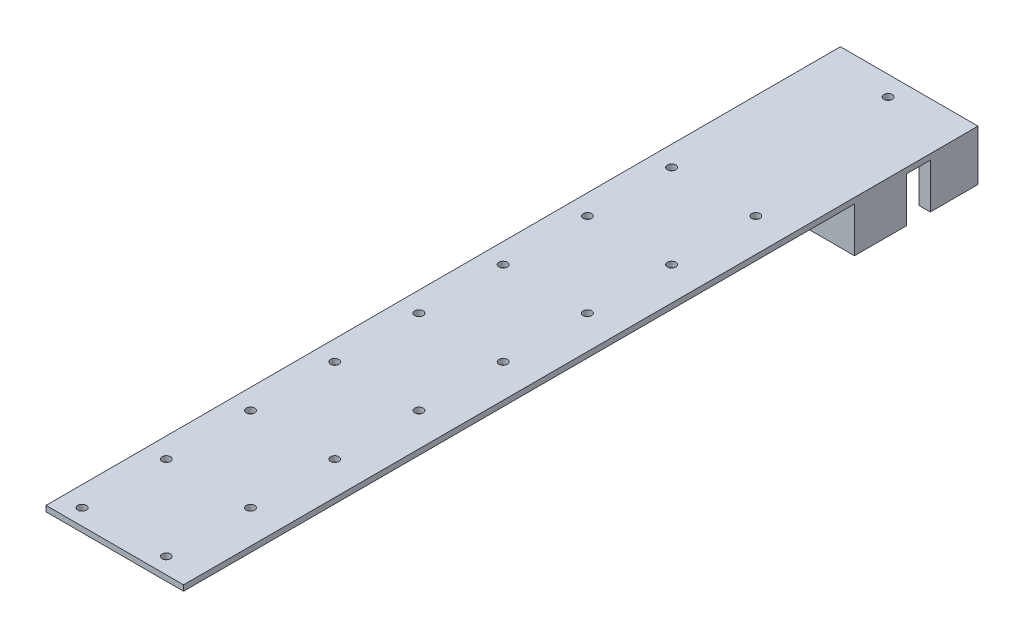
ISO-10303-21;
HEADER;
FILE_DESCRIPTION(('STEP AP214'),'2;1');
FILE_NAME('part.step','',(''),(''),'','','');
FILE_SCHEMA(('AUTOMOTIVE_DESIGN { 1 0 10303 214 1 1 1 1 }'));
ENDSEC;
DATA;
#1=APPLICATION_CONTEXT('core data for automotive mechanical design processes');
#2=APPLICATION_PROTOCOL_DEFINITION('international standard','automotive_design',2000,#1);
#3=PRODUCT_CONTEXT('',#1,'mechanical');
#4=PRODUCT('Part','Part','',(#3));
#5=PRODUCT_RELATED_PRODUCT_CATEGORY('part','',(#4));
#6=PRODUCT_DEFINITION_FORMATION('','',#4);
#7=PRODUCT_DEFINITION_CONTEXT('part definition',#1,'design');
#8=PRODUCT_DEFINITION('design','',#6,#7);
#9=PRODUCT_DEFINITION_SHAPE('','',#8);
#10=(LENGTH_UNIT() NAMED_UNIT(*) SI_UNIT(.MILLI.,.METRE.));
#11=(NAMED_UNIT(*) PLANE_ANGLE_UNIT() SI_UNIT($,.RADIAN.));
#12=(NAMED_UNIT(*) SI_UNIT($,.STERADIAN.) SOLID_ANGLE_UNIT());
#13=UNCERTAINTY_MEASURE_WITH_UNIT(LENGTH_MEASURE(1.E-05),#10,'distance_accuracy_value','');
#14=(GEOMETRIC_REPRESENTATION_CONTEXT(3) GLOBAL_UNCERTAINTY_ASSIGNED_CONTEXT((#13)) GLOBAL_UNIT_ASSIGNED_CONTEXT((#10,
#11,#12)) REPRESENTATION_CONTEXT('',''));
#15=CARTESIAN_POINT('',(0.,0.,0.));
#16=DIRECTION('',(0.,0.,1.));
#17=DIRECTION('',(1.,0.,0.));
#18=AXIS2_PLACEMENT_3D('',#15,#16,#17);
#19=CARTESIAN_POINT('',(0.,0.,0.));
#20=DIRECTION('',(0.,-1.,0.));
#21=DIRECTION('',(0.,0.,-1.));
#22=AXIS2_PLACEMENT_3D('',#19,#20,#21);
#23=PLANE('',#22);
#24=CARTESIAN_POINT('',(-0.5,0.,-134.5));
#25=DIRECTION('',(0.,-1.,0.));
#26=DIRECTION('',(0.,0.,-1.));
#27=AXIS2_PLACEMENT_3D('',#24,#25,#26);
#28=CIRCLE('',#27,1.5);
#29=CARTESIAN_POINT('',(-0.5,0.,-136.));
#30=VERTEX_POINT('',#29);
#31=EDGE_CURVE('E881',#30,#30,#28,.T.);
#32=ORIENTED_EDGE('',*,*,#31,.F.);
#33=EDGE_LOOP('',(#32));
#34=FACE_BOUND('',#33,.T.);
#35=CARTESIAN_POINT('',(12.6500000000019,0.,105.8));
#36=DIRECTION('',(0.,1.,0.));
#37=DIRECTION('',(0.,0.,1.));
#38=AXIS2_PLACEMENT_3D('',#35,#36,#37);
#39=CIRCLE('',#38,1.5);
#40=CARTESIAN_POINT('',(12.6500000000019,0.,107.3));
#41=VERTEX_POINT('',#40);
#42=EDGE_CURVE('E260',#41,#41,#39,.T.);
#43=ORIENTED_EDGE('',*,*,#42,.T.);
#44=EDGE_LOOP('',(#43));
#45=FACE_BOUND('',#44,.T.);
#46=CARTESIAN_POINT('',(12.6500000000013,0.,45.8000000000003));
#47=DIRECTION('',(0.,1.,0.));
#48=DIRECTION('',(0.,0.,1.));
#49=AXIS2_PLACEMENT_3D('',#46,#47,#48);
#50=CIRCLE('',#49,1.5);
#51=CARTESIAN_POINT('',(12.6500000000013,0.,47.3000000000003));
#52=VERTEX_POINT('',#51);
#53=EDGE_CURVE('E276',#52,#52,#50,.T.);
#54=ORIENTED_EDGE('',*,*,#53,.T.);
#55=EDGE_LOOP('',(#54));
#56=FACE_BOUND('',#55,.T.);
#57=CARTESIAN_POINT('',(12.6500000000006,0.,-14.1999999999997));
#58=DIRECTION('',(0.,1.,0.));
#59=DIRECTION('',(0.,0.,1.));
#60=AXIS2_PLACEMENT_3D('',#57,#58,#59);
#61=CIRCLE('',#60,1.5);
#62=CARTESIAN_POINT('',(12.6500000000006,0.,-12.6999999999997));
#63=VERTEX_POINT('',#62);
#64=EDGE_CURVE('E292',#63,#63,#61,.T.);
#65=ORIENTED_EDGE('',*,*,#64,.T.);
#66=EDGE_LOOP('',(#65));
#67=FACE_BOUND('',#66,.T.);
#68=CARTESIAN_POINT('',(-17.3499999999978,0.,135.8));
#69=DIRECTION('',(0.,1.,0.));
#70=DIRECTION('',(0.,0.,1.));
#71=AXIS2_PLACEMENT_3D('',#68,#69,#70);
#72=CIRCLE('',#71,1.5);
#73=CARTESIAN_POINT('',(-17.3499999999978,0.,137.3));
#74=VERTEX_POINT('',#73);
#75=EDGE_CURVE('E308',#74,#74,#72,.T.);
#76=ORIENTED_EDGE('',*,*,#75,.T.);
#77=EDGE_LOOP('',(#76));
#78=FACE_BOUND('',#77,.T.);
#79=CARTESIAN_POINT('',(-17.3499999999984,0.,75.8000000000005));
#80=DIRECTION('',(0.,1.,0.));
#81=DIRECTION('',(0.,0.,1.));
#82=AXIS2_PLACEMENT_3D('',#79,#80,#81);
#83=CIRCLE('',#82,1.5);
#84=CARTESIAN_POINT('',(-17.3499999999984,0.,77.3000000000005));
#85=VERTEX_POINT('',#84);
#86=EDGE_CURVE('E324',#85,#85,#83,.T.);
#87=ORIENTED_EDGE('',*,*,#86,.T.);
#88=EDGE_LOOP('',(#87));
#89=FACE_BOUND('',#88,.T.);
#90=CARTESIAN_POINT('',(-17.3499999999991,0.,15.8000000000005));
#91=DIRECTION('',(0.,1.,0.));
#92=DIRECTION('',(0.,0.,1.));
#93=AXIS2_PLACEMENT_3D('',#90,#91,#92);
#94=CIRCLE('',#93,1.5);
#95=CARTESIAN_POINT('',(-17.3499999999991,0.,17.3000000000005));
#96=VERTEX_POINT('',#95);
#97=EDGE_CURVE('E340',#96,#96,#94,.T.);
#98=ORIENTED_EDGE('',*,*,#97,.T.);
#99=EDGE_LOOP('',(#98));
#100=FACE_BOUND('',#99,.T.);
#101=CARTESIAN_POINT('',(-17.3499999999997,0.,-44.1999999999995));
#102=DIRECTION('',(0.,1.,0.));
#103=DIRECTION('',(0.,0.,1.));
#104=AXIS2_PLACEMENT_3D('',#101,#102,#103);
#105=CIRCLE('',#104,1.5);
#106=CARTESIAN_POINT('',(-17.3499999999997,0.,-42.6999999999995));
#107=VERTEX_POINT('',#106);
#108=EDGE_CURVE('E356',#107,#107,#105,.T.);
#109=ORIENTED_EDGE('',*,*,#108,.T.);
#110=EDGE_LOOP('',(#109));
#111=FACE_BOUND('',#110,.T.);
#112=CARTESIAN_POINT('',(12.65,0.,-74.1999999999997));
#113=DIRECTION('',(0.,1.,0.));
#114=DIRECTION('',(0.,0.,1.));
#115=AXIS2_PLACEMENT_3D('',#112,#113,#114);
#116=CIRCLE('',#115,1.5);
#117=CARTESIAN_POINT('',(12.65,0.,-72.6999999999997));
#118=VERTEX_POINT('',#117);
#119=EDGE_CURVE('E372',#118,#118,#116,.T.);
#120=ORIENTED_EDGE('',*,*,#119,.T.);
#121=EDGE_LOOP('',(#120));
#122=FACE_BOUND('',#121,.T.);
#123=CARTESIAN_POINT('',(-17.35,0.,-74.1999999999995));
#124=DIRECTION('',(0.,1.,0.));
#125=DIRECTION('',(0.,0.,1.));
#126=AXIS2_PLACEMENT_3D('',#123,#124,#125);
#127=CIRCLE('',#126,1.5);
#128=CARTESIAN_POINT('',(-17.35,0.,-72.6999999999995));
#129=VERTEX_POINT('',#128);
#130=EDGE_CURVE('E364',#129,#129,#127,.T.);
#131=ORIENTED_EDGE('',*,*,#130,.T.);
#132=EDGE_LOOP('',(#131));
#133=FACE_BOUND('',#132,.T.);
#134=CARTESIAN_POINT('',(-17.3499999999994,0.,-14.1999999999995));
#135=DIRECTION('',(0.,1.,0.));
#136=DIRECTION('',(0.,0.,1.));
#137=AXIS2_PLACEMENT_3D('',#134,#135,#136);
#138=CIRCLE('',#137,1.5);
#139=CARTESIAN_POINT('',(-17.3499999999994,0.,-12.6999999999995));
#140=VERTEX_POINT('',#139);
#141=EDGE_CURVE('E348',#140,#140,#138,.T.);
#142=ORIENTED_EDGE('',*,*,#141,.T.);
#143=EDGE_LOOP('',(#142));
#144=FACE_BOUND('',#143,.T.);
#145=CARTESIAN_POINT('',(-17.3499999999987,0.,45.8000000000005));
#146=DIRECTION('',(0.,1.,0.));
#147=DIRECTION('',(0.,0.,1.));
#148=AXIS2_PLACEMENT_3D('',#145,#146,#147);
#149=CIRCLE('',#148,1.5);
#150=CARTESIAN_POINT('',(-17.3499999999987,0.,47.3000000000005));
#151=VERTEX_POINT('',#150);
#152=EDGE_CURVE('E332',#151,#151,#149,.T.);
#153=ORIENTED_EDGE('',*,*,#152,.T.);
#154=EDGE_LOOP('',(#153));
#155=FACE_BOUND('',#154,.T.);
#156=CARTESIAN_POINT('',(-17.3499999999981,0.,105.800000000001));
#157=DIRECTION('',(0.,1.,0.));
#158=DIRECTION('',(0.,0.,1.));
#159=AXIS2_PLACEMENT_3D('',#156,#157,#158);
#160=CIRCLE('',#159,1.5);
#161=CARTESIAN_POINT('',(-17.3499999999981,0.,107.300000000001));
#162=VERTEX_POINT('',#161);
#163=EDGE_CURVE('E316',#162,#162,#160,.T.);
#164=ORIENTED_EDGE('',*,*,#163,.T.);
#165=EDGE_LOOP('',(#164));
#166=FACE_BOUND('',#165,.T.);
#167=CARTESIAN_POINT('',(12.6500000000003,0.,-44.1999999999997));
#168=DIRECTION('',(0.,1.,0.));
#169=DIRECTION('',(0.,0.,1.));
#170=AXIS2_PLACEMENT_3D('',#167,#168,#169);
#171=CIRCLE('',#170,1.5);
#172=CARTESIAN_POINT('',(12.6500000000003,0.,-42.6999999999997));
#173=VERTEX_POINT('',#172);
#174=EDGE_CURVE('E300',#173,#173,#171,.T.);
#175=ORIENTED_EDGE('',*,*,#174,.T.);
#176=EDGE_LOOP('',(#175));
#177=FACE_BOUND('',#176,.T.);
#178=CARTESIAN_POINT('',(12.6500000000009,0.,15.8000000000003));
#179=DIRECTION('',(0.,1.,0.));
#180=DIRECTION('',(0.,0.,1.));
#181=AXIS2_PLACEMENT_3D('',#178,#179,#180);
#182=CIRCLE('',#181,1.5);
#183=CARTESIAN_POINT('',(12.6500000000009,0.,17.3000000000003));
#184=VERTEX_POINT('',#183);
#185=EDGE_CURVE('E284',#184,#184,#182,.T.);
#186=ORIENTED_EDGE('',*,*,#185,.T.);
#187=EDGE_LOOP('',(#186));
#188=FACE_BOUND('',#187,.T.);
#189=CARTESIAN_POINT('',(12.6500000000016,0.,75.8000000000003));
#190=DIRECTION('',(0.,1.,0.));
#191=DIRECTION('',(0.,0.,1.));
#192=AXIS2_PLACEMENT_3D('',#189,#190,#191);
#193=CIRCLE('',#192,1.5);
#194=CARTESIAN_POINT('',(12.6500000000016,0.,77.3000000000003));
#195=VERTEX_POINT('',#194);
#196=EDGE_CURVE('E268',#195,#195,#193,.T.);
#197=ORIENTED_EDGE('',*,*,#196,.T.);
#198=EDGE_LOOP('',(#197));
#199=FACE_BOUND('',#198,.T.);
#200=CARTESIAN_POINT('',(12.6500000000022,0.,135.8));
#201=DIRECTION('',(0.,1.,0.));
#202=DIRECTION('',(0.,0.,1.));
#203=AXIS2_PLACEMENT_3D('',#200,#201,#202);
#204=CIRCLE('',#203,1.5);
#205=CARTESIAN_POINT('',(12.6500000000022,0.,137.3));
#206=VERTEX_POINT('',#205);
#207=EDGE_CURVE('E255',#206,#206,#204,.T.);
#208=ORIENTED_EDGE('',*,*,#207,.T.);
#209=EDGE_LOOP('',(#208));
#210=FACE_BOUND('',#209,.T.);
#211=DIRECTION('',(-1.,0.,0.));
#212=VECTOR('',#211,1.);
#213=CARTESIAN_POINT('',(-24.5,0.,-141.5));
#214=LINE('',#213,#212);
#215=CARTESIAN_POINT('',(20.5,0.,-141.5));
#216=VERTEX_POINT('',#215);
#217=CARTESIAN_POINT('',(-19.1,0.,-141.5));
#218=VERTEX_POINT('',#217);
#219=EDGE_CURVE('E404',#216,#218,#214,.T.);
#220=ORIENTED_EDGE('',*,*,#219,.F.);
#221=DIRECTION('',(0.,0.,-1.));
#222=VECTOR('',#221,1.);
#223=CARTESIAN_POINT('',(20.5,0.,-124.5));
#224=LINE('',#223,#222);
#225=CARTESIAN_POINT('',(20.5,0.,-124.5));
#226=VERTEX_POINT('',#225);
#227=EDGE_CURVE('E56',#226,#216,#224,.T.);
#228=ORIENTED_EDGE('',*,*,#227,.F.);
#229=DIRECTION('',(-1.,0.,0.));
#230=VECTOR('',#229,1.);
#231=CARTESIAN_POINT('',(20.5,0.,-124.5));
#232=LINE('',#231,#230);
#233=CARTESIAN_POINT('',(24.5,0.,-124.5));
#234=VERTEX_POINT('',#233);
#235=EDGE_CURVE('E168',#234,#226,#232,.T.);
#236=ORIENTED_EDGE('',*,*,#235,.F.);
#237=DIRECTION('',(0.,0.,-1.));
#238=VECTOR('',#237,1.);
#239=CARTESIAN_POINT('',(24.5,0.,141.5));
#240=LINE('',#239,#238);
#241=CARTESIAN_POINT('',(24.5,0.,-116.1));
#242=VERTEX_POINT('',#241);
#243=EDGE_CURVE('E380',#242,#234,#240,.T.);
#244=ORIENTED_EDGE('',*,*,#243,.F.);
#245=DIRECTION('',(1.,0.,0.));
#246=VECTOR('',#245,1.);
#247=CARTESIAN_POINT('',(-18.3,0.,-116.1));
#248=LINE('',#247,#246);
#249=CARTESIAN_POINT('',(-18.3,0.,-116.1));
#250=VERTEX_POINT('',#249);
#251=EDGE_CURVE('E233',#250,#242,#248,.T.);
#252=ORIENTED_EDGE('',*,*,#251,.F.);
#253=DIRECTION('',(0.,0.,-1.));
#254=VECTOR('',#253,1.);
#255=CARTESIAN_POINT('',(-18.3,0.,-97.4999999999997));
#256=LINE('',#255,#254);
#257=CARTESIAN_POINT('',(-18.3,0.,-97.4999999999997));
#258=VERTEX_POINT('',#257);
#259=EDGE_CURVE('E214',#258,#250,#256,.T.);
#260=ORIENTED_EDGE('',*,*,#259,.F.);
#261=DIRECTION('',(-1.,0.,0.));
#262=VECTOR('',#261,1.);
#263=CARTESIAN_POINT('',(-18.3,0.,-97.4999999999997));
#264=LINE('',#263,#262);
#265=CARTESIAN_POINT('',(24.5,0.,-97.4999999999997));
#266=VERTEX_POINT('',#265);
#267=EDGE_CURVE('E220',#266,#258,#264,.T.);
#268=ORIENTED_EDGE('',*,*,#267,.F.);
#269=CARTESIAN_POINT('',(24.5,0.,141.5));
#270=VERTEX_POINT('',#269);
#271=EDGE_CURVE('E399',#270,#266,#240,.T.);
#272=ORIENTED_EDGE('',*,*,#271,.F.);
#273=DIRECTION('',(1.,0.,0.));
#274=VECTOR('',#273,1.);
#275=CARTESIAN_POINT('',(-24.5,0.,141.5));
#276=LINE('',#275,#274);
#277=CARTESIAN_POINT('',(-24.5,0.,141.5));
#278=VERTEX_POINT('',#277);
#279=EDGE_CURVE('E389',#278,#270,#276,.T.);
#280=ORIENTED_EDGE('',*,*,#279,.F.);
#281=DIRECTION('',(0.,0.,1.));
#282=VECTOR('',#281,1.);
#283=CARTESIAN_POINT('',(-24.5,0.,141.5));
#284=LINE('',#283,#282);
#285=CARTESIAN_POINT('',(-24.5,0.,-141.5));
#286=VERTEX_POINT('',#285);
#287=EDGE_CURVE('E407',#286,#278,#284,.T.);
#288=ORIENTED_EDGE('',*,*,#287,.F.);
#289=CARTESIAN_POINT('',(-23.1,0.,-141.5));
#290=VERTEX_POINT('',#289);
#291=EDGE_CURVE('E403',#290,#286,#214,.T.);
#292=ORIENTED_EDGE('',*,*,#291,.F.);
#293=DIRECTION('',(0.,0.,-1.));
#294=VECTOR('',#293,1.);
#295=CARTESIAN_POINT('',(-23.1,0.,-124.5));
#296=LINE('',#295,#294);
#297=CARTESIAN_POINT('',(-23.1,0.,-124.5));
#298=VERTEX_POINT('',#297);
#299=EDGE_CURVE('E64',#298,#290,#296,.T.);
#300=ORIENTED_EDGE('',*,*,#299,.F.);
#301=DIRECTION('',(-1.,0.,0.));
#302=VECTOR('',#301,1.);
#303=CARTESIAN_POINT('',(-23.1,0.,-124.5));
#304=LINE('',#303,#302);
#305=CARTESIAN_POINT('',(-19.1,0.,-124.5));
#306=VERTEX_POINT('',#305);
#307=EDGE_CURVE('E187',#306,#298,#304,.T.);
#308=ORIENTED_EDGE('',*,*,#307,.F.);
#309=DIRECTION('',(0.,0.,1.));
#310=VECTOR('',#309,1.);
#311=CARTESIAN_POINT('',(-19.1,0.,-124.5));
#312=LINE('',#311,#310);
#313=EDGE_CURVE('E176',#218,#306,#312,.T.);
#314=ORIENTED_EDGE('',*,*,#313,.F.);
#315=EDGE_LOOP('',(#220,#228,#236,#244,#252,#260,#268,#272,#280,#288,#292,#300,#308,#314));
#316=FACE_BOUND('',#315,.T.);
#317=ADVANCED_FACE('F39',(#34,#45,#56,#67,#78,#89,#100,#111,#122,#133,#144,#155,#166,#177,#188,
#199,#210,#316),#23,.T.);
#318=CARTESIAN_POINT('',(0.,2.,0.));
#319=DIRECTION('',(0.,-1.,0.));
#320=DIRECTION('',(0.,0.,-1.));
#321=AXIS2_PLACEMENT_3D('',#318,#319,#320);
#322=PLANE('',#321);
#323=CARTESIAN_POINT('',(-0.5,2.,-134.5));
#324=DIRECTION('',(0.,-1.,0.));
#325=DIRECTION('',(0.,0.,-1.));
#326=AXIS2_PLACEMENT_3D('',#323,#324,#325);
#327=CIRCLE('',#326,1.5);
#328=CARTESIAN_POINT('',(-0.5,2.,-136.));
#329=VERTEX_POINT('',#328);
#330=EDGE_CURVE('E43',#329,#329,#327,.T.);
#331=ORIENTED_EDGE('',*,*,#330,.T.);
#332=EDGE_LOOP('',(#331));
#333=FACE_BOUND('',#332,.T.);
#334=DIRECTION('',(0.,0.,-1.));
#335=VECTOR('',#334,1.);
#336=CARTESIAN_POINT('',(24.5,2.,141.5));
#337=LINE('',#336,#335);
#338=CARTESIAN_POINT('',(24.5,2.,141.5));
#339=VERTEX_POINT('',#338);
#340=CARTESIAN_POINT('',(24.5,2.,-141.5));
#341=VERTEX_POINT('',#340);
#342=EDGE_CURVE('E384',#339,#341,#337,.T.);
#343=ORIENTED_EDGE('',*,*,#342,.T.);
#344=DIRECTION('',(-1.,0.,0.));
#345=VECTOR('',#344,1.);
#346=CARTESIAN_POINT('',(-24.5,2.,-141.5));
#347=LINE('',#346,#345);
#348=CARTESIAN_POINT('',(-24.5,2.,-141.5));
#349=VERTEX_POINT('',#348);
#350=EDGE_CURVE('E388',#341,#349,#347,.T.);
#351=ORIENTED_EDGE('',*,*,#350,.T.);
#352=DIRECTION('',(0.,0.,1.));
#353=VECTOR('',#352,1.);
#354=CARTESIAN_POINT('',(-24.5,2.,141.5));
#355=LINE('',#354,#353);
#356=CARTESIAN_POINT('',(-24.5,2.,141.5));
#357=VERTEX_POINT('',#356);
#358=EDGE_CURVE('E392',#349,#357,#355,.T.);
#359=ORIENTED_EDGE('',*,*,#358,.T.);
#360=DIRECTION('',(1.,0.,0.));
#361=VECTOR('',#360,1.);
#362=CARTESIAN_POINT('',(-24.5,2.,141.5));
#363=LINE('',#362,#361);
#364=EDGE_CURVE('E395',#357,#339,#363,.T.);
#365=ORIENTED_EDGE('',*,*,#364,.T.);
#366=EDGE_LOOP('',(#343,#351,#359,#365));
#367=FACE_BOUND('',#366,.T.);
#368=CARTESIAN_POINT('',(12.65,2.,-74.1999999999997));
#369=DIRECTION('',(0.,1.,0.));
#370=DIRECTION('',(0.,0.,1.));
#371=AXIS2_PLACEMENT_3D('',#368,#369,#370);
#372=CIRCLE('',#371,1.5);
#373=CARTESIAN_POINT('',(12.65,2.,-72.6999999999997));
#374=VERTEX_POINT('',#373);
#375=EDGE_CURVE('E376',#374,#374,#372,.T.);
#376=ORIENTED_EDGE('',*,*,#375,.F.);
#377=EDGE_LOOP('',(#376));
#378=FACE_BOUND('',#377,.T.);
#379=CARTESIAN_POINT('',(-17.35,2.,-74.1999999999995));
#380=DIRECTION('',(0.,1.,0.));
#381=DIRECTION('',(0.,0.,1.));
#382=AXIS2_PLACEMENT_3D('',#379,#380,#381);
#383=CIRCLE('',#382,1.5);
#384=CARTESIAN_POINT('',(-17.35,2.,-72.6999999999995));
#385=VERTEX_POINT('',#384);
#386=EDGE_CURVE('E368',#385,#385,#383,.T.);
#387=ORIENTED_EDGE('',*,*,#386,.F.);
#388=EDGE_LOOP('',(#387));
#389=FACE_BOUND('',#388,.T.);
#390=CARTESIAN_POINT('',(-17.3499999999997,2.,-44.1999999999995));
#391=DIRECTION('',(0.,1.,0.));
#392=DIRECTION('',(0.,0.,1.));
#393=AXIS2_PLACEMENT_3D('',#390,#391,#392);
#394=CIRCLE('',#393,1.5);
#395=CARTESIAN_POINT('',(-17.3499999999997,2.,-42.6999999999995));
#396=VERTEX_POINT('',#395);
#397=EDGE_CURVE('E360',#396,#396,#394,.T.);
#398=ORIENTED_EDGE('',*,*,#397,.F.);
#399=EDGE_LOOP('',(#398));
#400=FACE_BOUND('',#399,.T.);
#401=CARTESIAN_POINT('',(-17.3499999999994,2.,-14.1999999999995));
#402=DIRECTION('',(0.,1.,0.));
#403=DIRECTION('',(0.,0.,1.));
#404=AXIS2_PLACEMENT_3D('',#401,#402,#403);
#405=CIRCLE('',#404,1.5);
#406=CARTESIAN_POINT('',(-17.3499999999994,2.,-12.6999999999995));
#407=VERTEX_POINT('',#406);
#408=EDGE_CURVE('E352',#407,#407,#405,.T.);
#409=ORIENTED_EDGE('',*,*,#408,.F.);
#410=EDGE_LOOP('',(#409));
#411=FACE_BOUND('',#410,.T.);
#412=CARTESIAN_POINT('',(-17.3499999999991,2.,15.8000000000005));
#413=DIRECTION('',(0.,1.,0.));
#414=DIRECTION('',(0.,0.,1.));
#415=AXIS2_PLACEMENT_3D('',#412,#413,#414);
#416=CIRCLE('',#415,1.5);
#417=CARTESIAN_POINT('',(-17.3499999999991,2.,17.3000000000005));
#418=VERTEX_POINT('',#417);
#419=EDGE_CURVE('E344',#418,#418,#416,.T.);
#420=ORIENTED_EDGE('',*,*,#419,.F.);
#421=EDGE_LOOP('',(#420));
#422=FACE_BOUND('',#421,.T.);
#423=CARTESIAN_POINT('',(-17.3499999999987,2.,45.8000000000005));
#424=DIRECTION('',(0.,1.,0.));
#425=DIRECTION('',(0.,0.,1.));
#426=AXIS2_PLACEMENT_3D('',#423,#424,#425);
#427=CIRCLE('',#426,1.5);
#428=CARTESIAN_POINT('',(-17.3499999999987,2.,47.3000000000005));
#429=VERTEX_POINT('',#428);
#430=EDGE_CURVE('E336',#429,#429,#427,.T.);
#431=ORIENTED_EDGE('',*,*,#430,.F.);
#432=EDGE_LOOP('',(#431));
#433=FACE_BOUND('',#432,.T.);
#434=CARTESIAN_POINT('',(-17.3499999999984,2.,75.8000000000005));
#435=DIRECTION('',(0.,1.,0.));
#436=DIRECTION('',(0.,0.,1.));
#437=AXIS2_PLACEMENT_3D('',#434,#435,#436);
#438=CIRCLE('',#437,1.5);
#439=CARTESIAN_POINT('',(-17.3499999999984,2.,77.3000000000005));
#440=VERTEX_POINT('',#439);
#441=EDGE_CURVE('E328',#440,#440,#438,.T.);
#442=ORIENTED_EDGE('',*,*,#441,.F.);
#443=EDGE_LOOP('',(#442));
#444=FACE_BOUND('',#443,.T.);
#445=CARTESIAN_POINT('',(-17.3499999999981,2.,105.800000000001));
#446=DIRECTION('',(0.,1.,0.));
#447=DIRECTION('',(0.,0.,1.));
#448=AXIS2_PLACEMENT_3D('',#445,#446,#447);
#449=CIRCLE('',#448,1.5);
#450=CARTESIAN_POINT('',(-17.3499999999981,2.,107.300000000001));
#451=VERTEX_POINT('',#450);
#452=EDGE_CURVE('E320',#451,#451,#449,.T.);
#453=ORIENTED_EDGE('',*,*,#452,.F.);
#454=EDGE_LOOP('',(#453));
#455=FACE_BOUND('',#454,.T.);
#456=CARTESIAN_POINT('',(-17.3499999999978,2.,135.8));
#457=DIRECTION('',(0.,1.,0.));
#458=DIRECTION('',(0.,0.,1.));
#459=AXIS2_PLACEMENT_3D('',#456,#457,#458);
#460=CIRCLE('',#459,1.5);
#461=CARTESIAN_POINT('',(-17.3499999999978,2.,137.3));
#462=VERTEX_POINT('',#461);
#463=EDGE_CURVE('E312',#462,#462,#460,.T.);
#464=ORIENTED_EDGE('',*,*,#463,.F.);
#465=EDGE_LOOP('',(#464));
#466=FACE_BOUND('',#465,.T.);
#467=CARTESIAN_POINT('',(12.6500000000003,2.,-44.1999999999997));
#468=DIRECTION('',(0.,1.,0.));
#469=DIRECTION('',(0.,0.,1.));
#470=AXIS2_PLACEMENT_3D('',#467,#468,#469);
#471=CIRCLE('',#470,1.5);
#472=CARTESIAN_POINT('',(12.6500000000003,2.,-42.6999999999997));
#473=VERTEX_POINT('',#472);
#474=EDGE_CURVE('E304',#473,#473,#471,.T.);
#475=ORIENTED_EDGE('',*,*,#474,.F.);
#476=EDGE_LOOP('',(#475));
#477=FACE_BOUND('',#476,.T.);
#478=CARTESIAN_POINT('',(12.6500000000006,2.,-14.1999999999997));
#479=DIRECTION('',(0.,1.,0.));
#480=DIRECTION('',(0.,0.,1.));
#481=AXIS2_PLACEMENT_3D('',#478,#479,#480);
#482=CIRCLE('',#481,1.5);
#483=CARTESIAN_POINT('',(12.6500000000006,2.,-12.6999999999997));
#484=VERTEX_POINT('',#483);
#485=EDGE_CURVE('E296',#484,#484,#482,.T.);
#486=ORIENTED_EDGE('',*,*,#485,.F.);
#487=EDGE_LOOP('',(#486));
#488=FACE_BOUND('',#487,.T.);
#489=CARTESIAN_POINT('',(12.6500000000009,2.,15.8000000000003));
#490=DIRECTION('',(0.,1.,0.));
#491=DIRECTION('',(0.,0.,1.));
#492=AXIS2_PLACEMENT_3D('',#489,#490,#491);
#493=CIRCLE('',#492,1.5);
#494=CARTESIAN_POINT('',(12.6500000000009,2.,17.3000000000003));
#495=VERTEX_POINT('',#494);
#496=EDGE_CURVE('E288',#495,#495,#493,.T.);
#497=ORIENTED_EDGE('',*,*,#496,.F.);
#498=EDGE_LOOP('',(#497));
#499=FACE_BOUND('',#498,.T.);
#500=CARTESIAN_POINT('',(12.6500000000013,2.,45.8000000000003));
#501=DIRECTION('',(0.,1.,0.));
#502=DIRECTION('',(0.,0.,1.));
#503=AXIS2_PLACEMENT_3D('',#500,#501,#502);
#504=CIRCLE('',#503,1.5);
#505=CARTESIAN_POINT('',(12.6500000000013,2.,47.3000000000003));
#506=VERTEX_POINT('',#505);
#507=EDGE_CURVE('E280',#506,#506,#504,.T.);
#508=ORIENTED_EDGE('',*,*,#507,.F.);
#509=EDGE_LOOP('',(#508));
#510=FACE_BOUND('',#509,.T.);
#511=CARTESIAN_POINT('',(12.6500000000016,2.,75.8000000000003));
#512=DIRECTION('',(0.,1.,0.));
#513=DIRECTION('',(0.,0.,1.));
#514=AXIS2_PLACEMENT_3D('',#511,#512,#513);
#515=CIRCLE('',#514,1.5);
#516=CARTESIAN_POINT('',(12.6500000000016,2.,77.3000000000003));
#517=VERTEX_POINT('',#516);
#518=EDGE_CURVE('E272',#517,#517,#515,.T.);
#519=ORIENTED_EDGE('',*,*,#518,.F.);
#520=EDGE_LOOP('',(#519));
#521=FACE_BOUND('',#520,.T.);
#522=CARTESIAN_POINT('',(12.6500000000019,2.,105.8));
#523=DIRECTION('',(0.,1.,0.));
#524=DIRECTION('',(0.,0.,1.));
#525=AXIS2_PLACEMENT_3D('',#522,#523,#524);
#526=CIRCLE('',#525,1.5);
#527=CARTESIAN_POINT('',(12.6500000000019,2.,107.3));
#528=VERTEX_POINT('',#527);
#529=EDGE_CURVE('E264',#528,#528,#526,.T.);
#530=ORIENTED_EDGE('',*,*,#529,.F.);
#531=EDGE_LOOP('',(#530));
#532=FACE_BOUND('',#531,.T.);
#533=CARTESIAN_POINT('',(12.6500000000022,2.,135.8));
#534=DIRECTION('',(0.,1.,0.));
#535=DIRECTION('',(0.,0.,1.));
#536=AXIS2_PLACEMENT_3D('',#533,#534,#535);
#537=CIRCLE('',#536,1.5);
#538=CARTESIAN_POINT('',(12.6500000000022,2.,137.3));
#539=VERTEX_POINT('',#538);
#540=EDGE_CURVE('E256',#539,#539,#537,.T.);
#541=ORIENTED_EDGE('',*,*,#540,.F.);
#542=EDGE_LOOP('',(#541));
#543=FACE_BOUND('',#542,.T.);
#544=ADVANCED_FACE('F439',(#333,#367,#378,#389,#400,#411,#422,#433,#444,#455,#466,#477,#488,
#499,#510,#521,#532,#543),#322,.F.);
#545=CARTESIAN_POINT('',(24.5,2.,141.5));
#546=DIRECTION('',(-1.,0.,0.));
#547=DIRECTION('',(0.,0.,1.));
#548=AXIS2_PLACEMENT_3D('',#545,#546,#547);
#549=PLANE('',#548);
#550=ORIENTED_EDGE('',*,*,#271,.T.);
#551=DIRECTION('',(0.,1.,0.));
#552=VECTOR('',#551,1.);
#553=CARTESIAN_POINT('',(24.5,-16.,-97.4999999999997));
#554=LINE('',#553,#552);
#555=CARTESIAN_POINT('',(24.5,-16.,-97.4999999999997));
#556=VERTEX_POINT('',#555);
#557=EDGE_CURVE('E243',#556,#266,#554,.T.);
#558=ORIENTED_EDGE('',*,*,#557,.F.);
#559=DIRECTION('',(0.,0.,1.));
#560=VECTOR('',#559,1.);
#561=CARTESIAN_POINT('',(24.5,-16.,-97.4999999999997));
#562=LINE('',#561,#560);
#563=CARTESIAN_POINT('',(24.5,-16.,-116.1));
#564=VERTEX_POINT('',#563);
#565=EDGE_CURVE('E223',#564,#556,#562,.T.);
#566=ORIENTED_EDGE('',*,*,#565,.F.);
#567=DIRECTION('',(0.,1.,0.));
#568=VECTOR('',#567,1.);
#569=CARTESIAN_POINT('',(24.5,-16.,-116.1));
#570=LINE('',#569,#568);
#571=EDGE_CURVE('E247',#564,#242,#570,.T.);
#572=ORIENTED_EDGE('',*,*,#571,.T.);
#573=ORIENTED_EDGE('',*,*,#243,.T.);
#574=DIRECTION('',(0.,1.,0.));
#575=VECTOR('',#574,1.);
#576=CARTESIAN_POINT('',(24.5,-16.,-124.5));
#577=LINE('',#576,#575);
#578=CARTESIAN_POINT('',(24.5,-16.,-124.5));
#579=VERTEX_POINT('',#578);
#580=EDGE_CURVE('E172',#579,#234,#577,.T.);
#581=ORIENTED_EDGE('',*,*,#580,.F.);
#582=DIRECTION('',(0.,0.,1.));
#583=VECTOR('',#582,1.);
#584=CARTESIAN_POINT('',(24.5,-16.,-124.5));
#585=LINE('',#584,#583);
#586=CARTESIAN_POINT('',(24.5,-16.,-141.5));
#587=VERTEX_POINT('',#586);
#588=EDGE_CURVE('E159',#587,#579,#585,.T.);
#589=ORIENTED_EDGE('',*,*,#588,.F.);
#590=DIRECTION('',(0.,-1.,0.));
#591=VECTOR('',#590,1.);
#592=CARTESIAN_POINT('',(24.5,2.,-141.5));
#593=LINE('',#592,#591);
#594=EDGE_CURVE('E11',#341,#587,#593,.T.);
#595=ORIENTED_EDGE('',*,*,#594,.F.);
#596=ORIENTED_EDGE('',*,*,#342,.F.);
#597=DIRECTION('',(0.,-1.,0.));
#598=VECTOR('',#597,1.);
#599=CARTESIAN_POINT('',(24.5,2.,141.5));
#600=LINE('',#599,#598);
#601=EDGE_CURVE('E398',#339,#270,#600,.T.);
#602=ORIENTED_EDGE('',*,*,#601,.T.);
#603=EDGE_LOOP('',(#550,#558,#566,#572,#573,#581,#589,#595,#596,#602));
#604=FACE_BOUND('',#603,.T.);
#605=ADVANCED_FACE('F41',(#604),#549,.F.);
#606=CARTESIAN_POINT('',(-24.5,2.,-141.5));
#607=DIRECTION('',(0.,0.,1.));
#608=DIRECTION('',(1.,0.,0.));
#609=AXIS2_PLACEMENT_3D('',#606,#607,#608);
#610=PLANE('',#609);
#611=ORIENTED_EDGE('',*,*,#594,.T.);
#612=DIRECTION('',(1.,0.,0.));
#613=VECTOR('',#612,1.);
#614=CARTESIAN_POINT('',(20.5,-16.,-141.5));
#615=LINE('',#614,#613);
#616=CARTESIAN_POINT('',(20.5,-16.,-141.5));
#617=VERTEX_POINT('',#616);
#618=EDGE_CURVE('E150',#617,#587,#615,.T.);
#619=ORIENTED_EDGE('',*,*,#618,.F.);
#620=DIRECTION('',(0.,1.,0.));
#621=VECTOR('',#620,1.);
#622=CARTESIAN_POINT('',(20.5,-16.,-141.5));
#623=LINE('',#622,#621);
#624=EDGE_CURVE('E153',#617,#216,#623,.T.);
#625=ORIENTED_EDGE('',*,*,#624,.T.);
#626=ORIENTED_EDGE('',*,*,#219,.T.);
#627=DIRECTION('',(0.,1.,0.));
#628=VECTOR('',#627,1.);
#629=CARTESIAN_POINT('',(-19.1,-16.,-141.5));
#630=LINE('',#629,#628);
#631=CARTESIAN_POINT('',(-19.1,-16.,-141.5));
#632=VERTEX_POINT('',#631);
#633=EDGE_CURVE('E207',#632,#218,#630,.T.);
#634=ORIENTED_EDGE('',*,*,#633,.F.);
#635=DIRECTION('',(1.,0.,0.));
#636=VECTOR('',#635,1.);
#637=CARTESIAN_POINT('',(-23.1,-16.,-141.5));
#638=LINE('',#637,#636);
#639=CARTESIAN_POINT('',(-23.1,-16.,-141.5));
#640=VERTEX_POINT('',#639);
#641=EDGE_CURVE('E186',#640,#632,#638,.T.);
#642=ORIENTED_EDGE('',*,*,#641,.F.);
#643=DIRECTION('',(0.,1.,0.));
#644=VECTOR('',#643,1.);
#645=CARTESIAN_POINT('',(-23.1,-16.,-141.5));
#646=LINE('',#645,#644);
#647=EDGE_CURVE('E211',#640,#290,#646,.T.);
#648=ORIENTED_EDGE('',*,*,#647,.T.);
#649=ORIENTED_EDGE('',*,*,#291,.T.);
#650=DIRECTION('',(0.,-1.,0.));
#651=VECTOR('',#650,1.);
#652=CARTESIAN_POINT('',(-24.5,2.,-141.5));
#653=LINE('',#652,#651);
#654=EDGE_CURVE('E49',#349,#286,#653,.T.);
#655=ORIENTED_EDGE('',*,*,#654,.F.);
#656=ORIENTED_EDGE('',*,*,#350,.F.);
#657=EDGE_LOOP('',(#611,#619,#625,#626,#634,#642,#648,#649,#655,#656));
#658=FACE_BOUND('',#657,.T.);
#659=ADVANCED_FACE('F152',(#658),#610,.F.);
#660=CARTESIAN_POINT('',(-24.5,2.,141.5));
#661=DIRECTION('',(1.,0.,0.));
#662=DIRECTION('',(0.,0.,-1.));
#663=AXIS2_PLACEMENT_3D('',#660,#661,#662);
#664=PLANE('',#663);
#665=ORIENTED_EDGE('',*,*,#287,.T.);
#666=DIRECTION('',(0.,-1.,0.));
#667=VECTOR('',#666,1.);
#668=CARTESIAN_POINT('',(-24.5,2.,141.5));
#669=LINE('',#668,#667);
#670=EDGE_CURVE('E415',#357,#278,#669,.T.);
#671=ORIENTED_EDGE('',*,*,#670,.F.);
#672=ORIENTED_EDGE('',*,*,#358,.F.);
#673=ORIENTED_EDGE('',*,*,#654,.T.);
#674=EDGE_LOOP('',(#665,#671,#672,#673));
#675=FACE_BOUND('',#674,.T.);
#676=ADVANCED_FACE('F425',(#675),#664,.F.);
#677=CARTESIAN_POINT('',(-24.5,2.,141.5));
#678=DIRECTION('',(0.,0.,-1.));
#679=DIRECTION('',(-1.,0.,0.));
#680=AXIS2_PLACEMENT_3D('',#677,#678,#679);
#681=PLANE('',#680);
#682=ORIENTED_EDGE('',*,*,#279,.T.);
#683=ORIENTED_EDGE('',*,*,#601,.F.);
#684=ORIENTED_EDGE('',*,*,#364,.F.);
#685=ORIENTED_EDGE('',*,*,#670,.T.);
#686=EDGE_LOOP('',(#682,#683,#684,#685));
#687=FACE_BOUND('',#686,.T.);
#688=ADVANCED_FACE('F433',(#687),#681,.F.);
#689=CARTESIAN_POINT('',(12.65,2.,-74.1999999999997));
#690=DIRECTION('',(0.,-1.,0.));
#691=DIRECTION('',(0.,0.,-1.));
#692=AXIS2_PLACEMENT_3D('',#689,#690,#691);
#693=CYLINDRICAL_SURFACE('',#692,1.5);
#694=ORIENTED_EDGE('',*,*,#375,.T.);
#695=EDGE_LOOP('',(#694));
#696=FACE_BOUND('',#695,.T.);
#697=ORIENTED_EDGE('',*,*,#119,.F.);
#698=EDGE_LOOP('',(#697));
#699=FACE_BOUND('',#698,.T.);
#700=ADVANCED_FACE('F495',(#696,#699),#693,.F.);
#701=CARTESIAN_POINT('',(-17.35,2.,-74.1999999999995));
#702=DIRECTION('',(0.,-1.,0.));
#703=DIRECTION('',(0.,0.,-1.));
#704=AXIS2_PLACEMENT_3D('',#701,#702,#703);
#705=CYLINDRICAL_SURFACE('',#704,1.5);
#706=ORIENTED_EDGE('',*,*,#386,.T.);
#707=EDGE_LOOP('',(#706));
#708=FACE_BOUND('',#707,.T.);
#709=ORIENTED_EDGE('',*,*,#130,.F.);
#710=EDGE_LOOP('',(#709));
#711=FACE_BOUND('',#710,.T.);
#712=ADVANCED_FACE('F710',(#708,#711),#705,.F.);
#713=CARTESIAN_POINT('',(-17.3499999999997,2.,-44.1999999999995));
#714=DIRECTION('',(0.,-1.,0.));
#715=DIRECTION('',(0.,0.,-1.));
#716=AXIS2_PLACEMENT_3D('',#713,#714,#715);
#717=CYLINDRICAL_SURFACE('',#716,1.5);
#718=ORIENTED_EDGE('',*,*,#397,.T.);
#719=EDGE_LOOP('',(#718));
#720=FACE_BOUND('',#719,.T.);
#721=ORIENTED_EDGE('',*,*,#108,.F.);
#722=EDGE_LOOP('',(#721));
#723=FACE_BOUND('',#722,.T.);
#724=ADVANCED_FACE('F702',(#720,#723),#717,.F.);
#725=CARTESIAN_POINT('',(-17.3499999999994,2.,-14.1999999999995));
#726=DIRECTION('',(0.,-1.,0.));
#727=DIRECTION('',(0.,0.,-1.));
#728=AXIS2_PLACEMENT_3D('',#725,#726,#727);
#729=CYLINDRICAL_SURFACE('',#728,1.5);
#730=ORIENTED_EDGE('',*,*,#408,.T.);
#731=EDGE_LOOP('',(#730));
#732=FACE_BOUND('',#731,.T.);
#733=ORIENTED_EDGE('',*,*,#141,.F.);
#734=EDGE_LOOP('',(#733));
#735=FACE_BOUND('',#734,.T.);
#736=ADVANCED_FACE('F694',(#732,#735),#729,.F.);
#737=CARTESIAN_POINT('',(-17.3499999999991,2.,15.8000000000005));
#738=DIRECTION('',(0.,-1.,0.));
#739=DIRECTION('',(0.,0.,-1.));
#740=AXIS2_PLACEMENT_3D('',#737,#738,#739);
#741=CYLINDRICAL_SURFACE('',#740,1.5);
#742=ORIENTED_EDGE('',*,*,#419,.T.);
#743=EDGE_LOOP('',(#742));
#744=FACE_BOUND('',#743,.T.);
#745=ORIENTED_EDGE('',*,*,#97,.F.);
#746=EDGE_LOOP('',(#745));
#747=FACE_BOUND('',#746,.T.);
#748=ADVANCED_FACE('F686',(#744,#747),#741,.F.);
#749=CARTESIAN_POINT('',(-17.3499999999987,2.,45.8000000000005));
#750=DIRECTION('',(0.,-1.,0.));
#751=DIRECTION('',(0.,0.,-1.));
#752=AXIS2_PLACEMENT_3D('',#749,#750,#751);
#753=CYLINDRICAL_SURFACE('',#752,1.5);
#754=ORIENTED_EDGE('',*,*,#430,.T.);
#755=EDGE_LOOP('',(#754));
#756=FACE_BOUND('',#755,.T.);
#757=ORIENTED_EDGE('',*,*,#152,.F.);
#758=EDGE_LOOP('',(#757));
#759=FACE_BOUND('',#758,.T.);
#760=ADVANCED_FACE('F678',(#756,#759),#753,.F.);
#761=CARTESIAN_POINT('',(-17.3499999999984,2.,75.8000000000005));
#762=DIRECTION('',(0.,-1.,0.));
#763=DIRECTION('',(0.,0.,-1.));
#764=AXIS2_PLACEMENT_3D('',#761,#762,#763);
#765=CYLINDRICAL_SURFACE('',#764,1.5);
#766=ORIENTED_EDGE('',*,*,#441,.T.);
#767=EDGE_LOOP('',(#766));
#768=FACE_BOUND('',#767,.T.);
#769=ORIENTED_EDGE('',*,*,#86,.F.);
#770=EDGE_LOOP('',(#769));
#771=FACE_BOUND('',#770,.T.);
#772=ADVANCED_FACE('F670',(#768,#771),#765,.F.);
#773=CARTESIAN_POINT('',(-17.3499999999981,2.,105.800000000001));
#774=DIRECTION('',(0.,-1.,0.));
#775=DIRECTION('',(0.,0.,-1.));
#776=AXIS2_PLACEMENT_3D('',#773,#774,#775);
#777=CYLINDRICAL_SURFACE('',#776,1.5);
#778=ORIENTED_EDGE('',*,*,#452,.T.);
#779=EDGE_LOOP('',(#778));
#780=FACE_BOUND('',#779,.T.);
#781=ORIENTED_EDGE('',*,*,#163,.F.);
#782=EDGE_LOOP('',(#781));
#783=FACE_BOUND('',#782,.T.);
#784=ADVANCED_FACE('F662',(#780,#783),#777,.F.);
#785=CARTESIAN_POINT('',(-17.3499999999978,2.,135.8));
#786=DIRECTION('',(0.,-1.,0.));
#787=DIRECTION('',(0.,0.,-1.));
#788=AXIS2_PLACEMENT_3D('',#785,#786,#787);
#789=CYLINDRICAL_SURFACE('',#788,1.5);
#790=ORIENTED_EDGE('',*,*,#463,.T.);
#791=EDGE_LOOP('',(#790));
#792=FACE_BOUND('',#791,.T.);
#793=ORIENTED_EDGE('',*,*,#75,.F.);
#794=EDGE_LOOP('',(#793));
#795=FACE_BOUND('',#794,.T.);
#796=ADVANCED_FACE('F654',(#792,#795),#789,.F.);
#797=CARTESIAN_POINT('',(12.6500000000003,2.,-44.1999999999997));
#798=DIRECTION('',(0.,-1.,0.));
#799=DIRECTION('',(0.,0.,-1.));
#800=AXIS2_PLACEMENT_3D('',#797,#798,#799);
#801=CYLINDRICAL_SURFACE('',#800,1.5);
#802=ORIENTED_EDGE('',*,*,#474,.T.);
#803=EDGE_LOOP('',(#802));
#804=FACE_BOUND('',#803,.T.);
#805=ORIENTED_EDGE('',*,*,#174,.F.);
#806=EDGE_LOOP('',(#805));
#807=FACE_BOUND('',#806,.T.);
#808=ADVANCED_FACE('F646',(#804,#807),#801,.F.);
#809=CARTESIAN_POINT('',(12.6500000000006,2.,-14.1999999999997));
#810=DIRECTION('',(0.,-1.,0.));
#811=DIRECTION('',(0.,0.,-1.));
#812=AXIS2_PLACEMENT_3D('',#809,#810,#811);
#813=CYLINDRICAL_SURFACE('',#812,1.5);
#814=ORIENTED_EDGE('',*,*,#485,.T.);
#815=EDGE_LOOP('',(#814));
#816=FACE_BOUND('',#815,.T.);
#817=ORIENTED_EDGE('',*,*,#64,.F.);
#818=EDGE_LOOP('',(#817));
#819=FACE_BOUND('',#818,.T.);
#820=ADVANCED_FACE('F638',(#816,#819),#813,.F.);
#821=CARTESIAN_POINT('',(12.6500000000009,2.,15.8000000000003));
#822=DIRECTION('',(0.,-1.,0.));
#823=DIRECTION('',(0.,0.,-1.));
#824=AXIS2_PLACEMENT_3D('',#821,#822,#823);
#825=CYLINDRICAL_SURFACE('',#824,1.5);
#826=ORIENTED_EDGE('',*,*,#496,.T.);
#827=EDGE_LOOP('',(#826));
#828=FACE_BOUND('',#827,.T.);
#829=ORIENTED_EDGE('',*,*,#185,.F.);
#830=EDGE_LOOP('',(#829));
#831=FACE_BOUND('',#830,.T.);
#832=ADVANCED_FACE('F630',(#828,#831),#825,.F.);
#833=CARTESIAN_POINT('',(12.6500000000013,2.,45.8000000000003));
#834=DIRECTION('',(0.,-1.,0.));
#835=DIRECTION('',(0.,0.,-1.));
#836=AXIS2_PLACEMENT_3D('',#833,#834,#835);
#837=CYLINDRICAL_SURFACE('',#836,1.5);
#838=ORIENTED_EDGE('',*,*,#507,.T.);
#839=EDGE_LOOP('',(#838));
#840=FACE_BOUND('',#839,.T.);
#841=ORIENTED_EDGE('',*,*,#53,.F.);
#842=EDGE_LOOP('',(#841));
#843=FACE_BOUND('',#842,.T.);
#844=ADVANCED_FACE('F622',(#840,#843),#837,.F.);
#845=CARTESIAN_POINT('',(12.6500000000016,2.,75.8000000000003));
#846=DIRECTION('',(0.,-1.,0.));
#847=DIRECTION('',(0.,0.,-1.));
#848=AXIS2_PLACEMENT_3D('',#845,#846,#847);
#849=CYLINDRICAL_SURFACE('',#848,1.5);
#850=ORIENTED_EDGE('',*,*,#518,.T.);
#851=EDGE_LOOP('',(#850));
#852=FACE_BOUND('',#851,.T.);
#853=ORIENTED_EDGE('',*,*,#196,.F.);
#854=EDGE_LOOP('',(#853));
#855=FACE_BOUND('',#854,.T.);
#856=ADVANCED_FACE('F614',(#852,#855),#849,.F.);
#857=CARTESIAN_POINT('',(12.6500000000019,2.,105.8));
#858=DIRECTION('',(0.,-1.,0.));
#859=DIRECTION('',(0.,0.,-1.));
#860=AXIS2_PLACEMENT_3D('',#857,#858,#859);
#861=CYLINDRICAL_SURFACE('',#860,1.5);
#862=ORIENTED_EDGE('',*,*,#529,.T.);
#863=EDGE_LOOP('',(#862));
#864=FACE_BOUND('',#863,.T.);
#865=ORIENTED_EDGE('',*,*,#42,.F.);
#866=EDGE_LOOP('',(#865));
#867=FACE_BOUND('',#866,.T.);
#868=ADVANCED_FACE('F480',(#864,#867),#861,.F.);
#869=CARTESIAN_POINT('',(12.6500000000022,2.,135.8));
#870=DIRECTION('',(0.,-1.,0.));
#871=DIRECTION('',(0.,0.,-1.));
#872=AXIS2_PLACEMENT_3D('',#869,#870,#871);
#873=CYLINDRICAL_SURFACE('',#872,1.5);
#874=ORIENTED_EDGE('',*,*,#540,.T.);
#875=EDGE_LOOP('',(#874));
#876=FACE_BOUND('',#875,.T.);
#877=ORIENTED_EDGE('',*,*,#207,.F.);
#878=EDGE_LOOP('',(#877));
#879=FACE_BOUND('',#878,.T.);
#880=ADVANCED_FACE('F476',(#876,#879),#873,.F.);
#881=CARTESIAN_POINT('',(-18.3,-16.,-97.4999999999997));
#882=DIRECTION('',(1.,0.,0.));
#883=DIRECTION('',(0.,0.,-1.));
#884=AXIS2_PLACEMENT_3D('',#881,#882,#883);
#885=PLANE('',#884);
#886=ORIENTED_EDGE('',*,*,#259,.T.);
#887=DIRECTION('',(0.,1.,0.));
#888=VECTOR('',#887,1.);
#889=CARTESIAN_POINT('',(-18.3,-16.,-116.1));
#890=LINE('',#889,#888);
#891=CARTESIAN_POINT('',(-18.3,-16.,-116.1));
#892=VERTEX_POINT('',#891);
#893=EDGE_CURVE('E251',#892,#250,#890,.T.);
#894=ORIENTED_EDGE('',*,*,#893,.F.);
#895=DIRECTION('',(0.,0.,-1.));
#896=VECTOR('',#895,1.);
#897=CARTESIAN_POINT('',(-18.3,-16.,-97.4999999999997));
#898=LINE('',#897,#896);
#899=CARTESIAN_POINT('',(-18.3,-16.,-97.4999999999997));
#900=VERTEX_POINT('',#899);
#901=EDGE_CURVE('E215',#900,#892,#898,.T.);
#902=ORIENTED_EDGE('',*,*,#901,.F.);
#903=DIRECTION('',(0.,1.,0.));
#904=VECTOR('',#903,1.);
#905=CARTESIAN_POINT('',(-18.3,-16.,-97.4999999999997));
#906=LINE('',#905,#904);
#907=EDGE_CURVE('E229',#900,#258,#906,.T.);
#908=ORIENTED_EDGE('',*,*,#907,.T.);
#909=EDGE_LOOP('',(#886,#894,#902,#908));
#910=FACE_BOUND('',#909,.T.);
#911=ADVANCED_FACE('F479',(#910),#885,.F.);
#912=CARTESIAN_POINT('',(-18.3,-16.,-116.1));
#913=DIRECTION('',(0.,0.,1.));
#914=DIRECTION('',(1.,0.,0.));
#915=AXIS2_PLACEMENT_3D('',#912,#913,#914);
#916=PLANE('',#915);
#917=ORIENTED_EDGE('',*,*,#251,.T.);
#918=ORIENTED_EDGE('',*,*,#571,.F.);
#919=DIRECTION('',(1.,0.,0.));
#920=VECTOR('',#919,1.);
#921=CARTESIAN_POINT('',(-18.3,-16.,-116.1));
#922=LINE('',#921,#920);
#923=EDGE_CURVE('E219',#892,#564,#922,.T.);
#924=ORIENTED_EDGE('',*,*,#923,.F.);
#925=ORIENTED_EDGE('',*,*,#893,.T.);
#926=EDGE_LOOP('',(#917,#918,#924,#925));
#927=FACE_BOUND('',#926,.T.);
#928=ADVANCED_FACE('F589',(#927),#916,.F.);
#929=CARTESIAN_POINT('',(-18.3,-16.,-97.4999999999997));
#930=DIRECTION('',(0.,0.,-1.));
#931=DIRECTION('',(-1.,0.,0.));
#932=AXIS2_PLACEMENT_3D('',#929,#930,#931);
#933=PLANE('',#932);
#934=ORIENTED_EDGE('',*,*,#267,.T.);
#935=ORIENTED_EDGE('',*,*,#907,.F.);
#936=DIRECTION('',(-1.,0.,0.));
#937=VECTOR('',#936,1.);
#938=CARTESIAN_POINT('',(-18.3,-16.,-97.4999999999997));
#939=LINE('',#938,#937);
#940=EDGE_CURVE('E226',#556,#900,#939,.T.);
#941=ORIENTED_EDGE('',*,*,#940,.F.);
#942=ORIENTED_EDGE('',*,*,#557,.T.);
#943=EDGE_LOOP('',(#934,#935,#941,#942));
#944=FACE_BOUND('',#943,.T.);
#945=ADVANCED_FACE('F581',(#944),#933,.F.);
#946=CARTESIAN_POINT('',(0.,-16.,0.));
#947=DIRECTION('',(0.,-1.,0.));
#948=DIRECTION('',(0.,0.,-1.));
#949=AXIS2_PLACEMENT_3D('',#946,#947,#948);
#950=PLANE('',#949);
#951=ORIENTED_EDGE('',*,*,#901,.T.);
#952=ORIENTED_EDGE('',*,*,#923,.T.);
#953=ORIENTED_EDGE('',*,*,#565,.T.);
#954=ORIENTED_EDGE('',*,*,#940,.T.);
#955=EDGE_LOOP('',(#951,#952,#953,#954));
#956=FACE_BOUND('',#955,.T.);
#957=ADVANCED_FACE('F574',(#956),#950,.T.);
#958=CARTESIAN_POINT('',(-23.1,-16.,-124.5));
#959=DIRECTION('',(1.,0.,0.));
#960=DIRECTION('',(0.,0.,-1.));
#961=AXIS2_PLACEMENT_3D('',#958,#959,#960);
#962=PLANE('',#961);
#963=ORIENTED_EDGE('',*,*,#299,.T.);
#964=ORIENTED_EDGE('',*,*,#647,.F.);
#965=DIRECTION('',(0.,0.,-1.));
#966=VECTOR('',#965,1.);
#967=CARTESIAN_POINT('',(-23.1,-16.,-124.5));
#968=LINE('',#967,#966);
#969=CARTESIAN_POINT('',(-23.1,-16.,-124.5));
#970=VERTEX_POINT('',#969);
#971=EDGE_CURVE('E182',#970,#640,#968,.T.);
#972=ORIENTED_EDGE('',*,*,#971,.F.);
#973=DIRECTION('',(0.,1.,0.));
#974=VECTOR('',#973,1.);
#975=CARTESIAN_POINT('',(-23.1,-16.,-124.5));
#976=LINE('',#975,#974);
#977=EDGE_CURVE('E195',#970,#298,#976,.T.);
#978=ORIENTED_EDGE('',*,*,#977,.T.);
#979=EDGE_LOOP('',(#963,#964,#972,#978));
#980=FACE_BOUND('',#979,.T.);
#981=ADVANCED_FACE('F566',(#980),#962,.F.);
#982=CARTESIAN_POINT('',(-19.1,-16.,-124.5));
#983=DIRECTION('',(-1.,0.,0.));
#984=DIRECTION('',(0.,0.,1.));
#985=AXIS2_PLACEMENT_3D('',#982,#983,#984);
#986=PLANE('',#985);
#987=ORIENTED_EDGE('',*,*,#313,.T.);
#988=DIRECTION('',(0.,1.,0.));
#989=VECTOR('',#988,1.);
#990=CARTESIAN_POINT('',(-19.1,-16.,-124.5));
#991=LINE('',#990,#989);
#992=CARTESIAN_POINT('',(-19.1,-16.,-124.5));
#993=VERTEX_POINT('',#992);
#994=EDGE_CURVE('E203',#993,#306,#991,.T.);
#995=ORIENTED_EDGE('',*,*,#994,.F.);
#996=DIRECTION('',(0.,0.,1.));
#997=VECTOR('',#996,1.);
#998=CARTESIAN_POINT('',(-19.1,-16.,-124.5));
#999=LINE('',#998,#997);
#1000=EDGE_CURVE('E190',#632,#993,#999,.T.);
#1001=ORIENTED_EDGE('',*,*,#1000,.F.);
#1002=ORIENTED_EDGE('',*,*,#633,.T.);
#1003=EDGE_LOOP('',(#987,#995,#1001,#1002));
#1004=FACE_BOUND('',#1003,.T.);
#1005=ADVANCED_FACE('F558',(#1004),#986,.F.);
#1006=CARTESIAN_POINT('',(-23.1,-16.,-124.5));
#1007=DIRECTION('',(0.,0.,-1.));
#1008=DIRECTION('',(-1.,0.,0.));
#1009=AXIS2_PLACEMENT_3D('',#1006,#1007,#1008);
#1010=PLANE('',#1009);
#1011=ORIENTED_EDGE('',*,*,#307,.T.);
#1012=ORIENTED_EDGE('',*,*,#977,.F.);
#1013=DIRECTION('',(-1.,0.,0.));
#1014=VECTOR('',#1013,1.);
#1015=CARTESIAN_POINT('',(-23.1,-16.,-124.5));
#1016=LINE('',#1015,#1014);
#1017=EDGE_CURVE('E193',#993,#970,#1016,.T.);
#1018=ORIENTED_EDGE('',*,*,#1017,.F.);
#1019=ORIENTED_EDGE('',*,*,#994,.T.);
#1020=EDGE_LOOP('',(#1011,#1012,#1018,#1019));
#1021=FACE_BOUND('',#1020,.T.);
#1022=ADVANCED_FACE('F550',(#1021),#1010,.F.);
#1023=CARTESIAN_POINT('',(0.,-16.,0.));
#1024=DIRECTION('',(0.,-1.,0.));
#1025=DIRECTION('',(0.,0.,-1.));
#1026=AXIS2_PLACEMENT_3D('',#1023,#1024,#1025);
#1027=PLANE('',#1026);
#1028=ORIENTED_EDGE('',*,*,#971,.T.);
#1029=ORIENTED_EDGE('',*,*,#641,.T.);
#1030=ORIENTED_EDGE('',*,*,#1000,.T.);
#1031=ORIENTED_EDGE('',*,*,#1017,.T.);
#1032=EDGE_LOOP('',(#1028,#1029,#1030,#1031));
#1033=FACE_BOUND('',#1032,.T.);
#1034=ADVANCED_FACE('F543',(#1033),#1027,.T.);
#1035=CARTESIAN_POINT('',(20.5,-16.,-124.5));
#1036=DIRECTION('',(1.,0.,0.));
#1037=DIRECTION('',(0.,0.,-1.));
#1038=AXIS2_PLACEMENT_3D('',#1035,#1036,#1037);
#1039=PLANE('',#1038);
#1040=ORIENTED_EDGE('',*,*,#227,.T.);
#1041=ORIENTED_EDGE('',*,*,#624,.F.);
#1042=DIRECTION('',(0.,0.,-1.));
#1043=VECTOR('',#1042,1.);
#1044=CARTESIAN_POINT('',(20.5,-16.,-124.5));
#1045=LINE('',#1044,#1043);
#1046=CARTESIAN_POINT('',(20.5,-16.,-124.5));
#1047=VERTEX_POINT('',#1046);
#1048=EDGE_CURVE('E160',#1047,#617,#1045,.T.);
#1049=ORIENTED_EDGE('',*,*,#1048,.F.);
#1050=DIRECTION('',(0.,1.,0.));
#1051=VECTOR('',#1050,1.);
#1052=CARTESIAN_POINT('',(20.5,-16.,-124.5));
#1053=LINE('',#1052,#1051);
#1054=EDGE_CURVE('E178',#1047,#226,#1053,.T.);
#1055=ORIENTED_EDGE('',*,*,#1054,.T.);
#1056=EDGE_LOOP('',(#1040,#1041,#1049,#1055));
#1057=FACE_BOUND('',#1056,.T.);
#1058=ADVANCED_FACE('F170',(#1057),#1039,.F.);
#1059=CARTESIAN_POINT('',(20.5,-16.,-124.5));
#1060=DIRECTION('',(0.,0.,-1.));
#1061=DIRECTION('',(-1.,0.,0.));
#1062=AXIS2_PLACEMENT_3D('',#1059,#1060,#1061);
#1063=PLANE('',#1062);
#1064=ORIENTED_EDGE('',*,*,#235,.T.);
#1065=ORIENTED_EDGE('',*,*,#1054,.F.);
#1066=DIRECTION('',(-1.,0.,0.));
#1067=VECTOR('',#1066,1.);
#1068=CARTESIAN_POINT('',(20.5,-16.,-124.5));
#1069=LINE('',#1068,#1067);
#1070=EDGE_CURVE('E165',#579,#1047,#1069,.T.);
#1071=ORIENTED_EDGE('',*,*,#1070,.F.);
#1072=ORIENTED_EDGE('',*,*,#580,.T.);
#1073=EDGE_LOOP('',(#1064,#1065,#1071,#1072));
#1074=FACE_BOUND('',#1073,.T.);
#1075=ADVANCED_FACE('F530',(#1074),#1063,.F.);
#1076=CARTESIAN_POINT('',(0.,-16.,0.));
#1077=DIRECTION('',(0.,-1.,0.));
#1078=DIRECTION('',(0.,0.,-1.));
#1079=AXIS2_PLACEMENT_3D('',#1076,#1077,#1078);
#1080=PLANE('',#1079);
#1081=ORIENTED_EDGE('',*,*,#1048,.T.);
#1082=ORIENTED_EDGE('',*,*,#618,.T.);
#1083=ORIENTED_EDGE('',*,*,#588,.T.);
#1084=ORIENTED_EDGE('',*,*,#1070,.T.);
#1085=EDGE_LOOP('',(#1081,#1082,#1083,#1084));
#1086=FACE_BOUND('',#1085,.T.);
#1087=ADVANCED_FACE('F163',(#1086),#1080,.T.);
#1088=CARTESIAN_POINT('',(-0.5,16.,-134.5));
#1089=DIRECTION('',(0.,-1.,0.));
#1090=DIRECTION('',(0.,0.,-1.));
#1091=AXIS2_PLACEMENT_3D('',#1088,#1089,#1090);
#1092=CYLINDRICAL_SURFACE('',#1091,1.5);
#1093=ORIENTED_EDGE('',*,*,#31,.T.);
#1094=EDGE_LOOP('',(#1093));
#1095=FACE_BOUND('',#1094,.T.);
#1096=ORIENTED_EDGE('',*,*,#330,.F.);
#1097=EDGE_LOOP('',(#1096));
#1098=FACE_BOUND('',#1097,.T.);
#1099=ADVANCED_FACE('F517',(#1095,#1098),#1092,.F.);
#1100=CLOSED_SHELL('',(#317,#544,#605,#659,#676,#688,#700,#712,#724,#736,#748,#760,#772,#784,
#796,#808,#820,#832,#844,#856,#868,#880,#911,#928,#945,#957,#981,#1005,#1022,#1034,#1058,#1075,
#1087,#1099));
#1101=MANIFOLD_SOLID_BREP('B2',#1100);
#1102=ADVANCED_BREP_SHAPE_REPRESENTATION('',(#18,#1101),#14);
#1103=SHAPE_DEFINITION_REPRESENTATION(#9,#1102);
ENDSEC;
END-ISO-10303-21;
